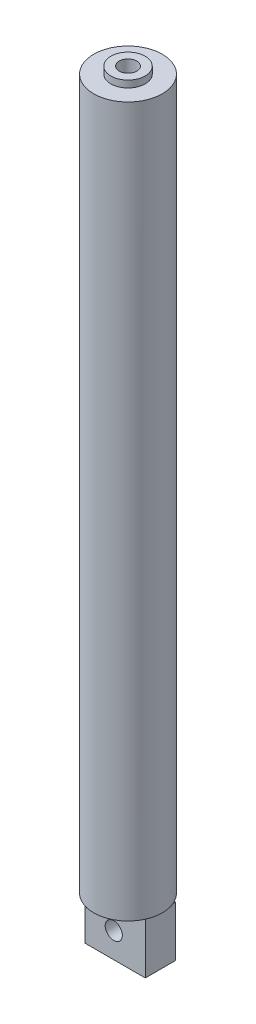
ISO-10303-21;
HEADER;
FILE_DESCRIPTION(('STEP AP214'),'2;1');
FILE_NAME('part.step','',(''),(''),'','','');
FILE_SCHEMA(('AUTOMOTIVE_DESIGN { 1 0 10303 214 1 1 1 1 }'));
ENDSEC;
DATA;
#1=APPLICATION_CONTEXT('core data for automotive mechanical design processes');
#2=APPLICATION_PROTOCOL_DEFINITION('international standard','automotive_design',2000,#1);
#3=PRODUCT_CONTEXT('',#1,'mechanical');
#4=PRODUCT('Part','Part','',(#3));
#5=PRODUCT_RELATED_PRODUCT_CATEGORY('part','',(#4));
#6=PRODUCT_DEFINITION_FORMATION('','',#4);
#7=PRODUCT_DEFINITION_CONTEXT('part definition',#1,'design');
#8=PRODUCT_DEFINITION('design','',#6,#7);
#9=PRODUCT_DEFINITION_SHAPE('','',#8);
#10=(LENGTH_UNIT() NAMED_UNIT(*) SI_UNIT(.MILLI.,.METRE.));
#11=(NAMED_UNIT(*) PLANE_ANGLE_UNIT() SI_UNIT($,.RADIAN.));
#12=(NAMED_UNIT(*) SI_UNIT($,.STERADIAN.) SOLID_ANGLE_UNIT());
#13=UNCERTAINTY_MEASURE_WITH_UNIT(LENGTH_MEASURE(1.E-05),#10,'distance_accuracy_value','');
#14=(GEOMETRIC_REPRESENTATION_CONTEXT(3) GLOBAL_UNCERTAINTY_ASSIGNED_CONTEXT((#13)) GLOBAL_UNIT_ASSIGNED_CONTEXT((#10,
#11,#12)) REPRESENTATION_CONTEXT('',''));
#15=CARTESIAN_POINT('',(0.,0.,0.));
#16=DIRECTION('',(0.,0.,1.));
#17=DIRECTION('',(1.,0.,0.));
#18=AXIS2_PLACEMENT_3D('',#15,#16,#17);
#19=CARTESIAN_POINT('',(0.,-4.31799999999993,0.));
#20=DIRECTION('',(0.,-1.,0.));
#21=DIRECTION('',(0.,0.,-1.));
#22=AXIS2_PLACEMENT_3D('',#19,#20,#21);
#23=PLANE('',#22);
#24=DIRECTION('',(0.,0.,1.));
#25=VECTOR('',#24,1.);
#26=CARTESIAN_POINT('',(-5.334,-4.31799999999993,2.64262624861142));
#27=LINE('',#26,#25);
#28=CARTESIAN_POINT('',(-5.334,-4.31799999999993,-2.93720091701856));
#29=VERTEX_POINT('',#28);
#30=CARTESIAN_POINT('',(-5.334,-4.31799999999993,2.64262624861142));
#31=VERTEX_POINT('',#30);
#32=EDGE_CURVE('E120',#29,#31,#27,.T.);
#33=ORIENTED_EDGE('',*,*,#32,.T.);
#34=DIRECTION('',(1.,0.,0.));
#35=VECTOR('',#34,1.);
#36=CARTESIAN_POINT('',(-5.334,-4.31799999999993,2.64262624861142));
#37=LINE('',#36,#35);
#38=CARTESIAN_POINT('',(5.77399571442081,-4.31799999999993,2.64262624861142));
#39=VERTEX_POINT('',#38);
#40=EDGE_CURVE('E107',#31,#39,#37,.T.);
#41=ORIENTED_EDGE('',*,*,#40,.T.);
#42=CARTESIAN_POINT('',(0.,-4.31799999999993,0.));
#43=DIRECTION('',(0.,-1.,0.));
#44=DIRECTION('',(0.,0.,-1.));
#45=AXIS2_PLACEMENT_3D('',#42,#43,#44);
#46=CIRCLE('',#45,6.35);
#47=CARTESIAN_POINT('',(5.62986241155726,-4.31799999999993,-2.93720091701856));
#48=VERTEX_POINT('',#47);
#49=EDGE_CURVE('E131',#39,#48,#46,.T.);
#50=ORIENTED_EDGE('',*,*,#49,.T.);
#51=DIRECTION('',(1.,0.,0.));
#52=VECTOR('',#51,1.);
#53=CARTESIAN_POINT('',(-5.334,-4.31799999999993,-2.93720091701856));
#54=LINE('',#53,#52);
#55=EDGE_CURVE('E129',#29,#48,#54,.T.);
#56=ORIENTED_EDGE('',*,*,#55,.F.);
#57=EDGE_LOOP('',(#33,#41,#50,#56));
#58=FACE_BOUND('',#57,.T.);
#59=ADVANCED_FACE('F33',(#58),#23,.T.);
#60=CARTESIAN_POINT('',(0.,127.,0.));
#61=DIRECTION('',(0.,1.,0.));
#62=DIRECTION('',(0.,0.,1.));
#63=AXIS2_PLACEMENT_3D('',#60,#61,#62);
#64=PLANE('',#63);
#65=CARTESIAN_POINT('',(0.,127.,0.));
#66=DIRECTION('',(0.,1.,0.));
#67=DIRECTION('',(0.,0.,1.));
#68=AXIS2_PLACEMENT_3D('',#65,#66,#67);
#69=CIRCLE('',#68,6.35);
#70=CARTESIAN_POINT('',(0.,127.,6.35));
#71=VERTEX_POINT('',#70);
#72=EDGE_CURVE('E42',#71,#71,#69,.T.);
#73=ORIENTED_EDGE('',*,*,#72,.T.);
#74=EDGE_LOOP('',(#73));
#75=FACE_BOUND('',#74,.T.);
#76=CARTESIAN_POINT('',(0.,127.,0.));
#77=DIRECTION('',(0.,1.,0.));
#78=DIRECTION('',(0.,0.,1.));
#79=AXIS2_PLACEMENT_3D('',#76,#77,#78);
#80=CIRCLE('',#79,3.175);
#81=CARTESIAN_POINT('',(0.,127.,3.175));
#82=VERTEX_POINT('',#81);
#83=EDGE_CURVE('E145',#82,#82,#80,.F.);
#84=ORIENTED_EDGE('',*,*,#83,.T.);
#85=EDGE_LOOP('',(#84));
#86=FACE_BOUND('',#85,.T.);
#87=ADVANCED_FACE('F168',(#75,#86),#64,.T.);
#88=CARTESIAN_POINT('',(0.,127.,0.));
#89=DIRECTION('',(0.,-1.,0.));
#90=DIRECTION('',(0.,0.,-1.));
#91=AXIS2_PLACEMENT_3D('',#88,#89,#90);
#92=CYLINDRICAL_SURFACE('',#91,6.35);
#93=ORIENTED_EDGE('',*,*,#72,.F.);
#94=EDGE_LOOP('',(#93));
#95=FACE_BOUND('',#94,.T.);
#96=CARTESIAN_POINT('',(5.84199999999994,-4.31799999999993,-2.48868157866786));
#97=VERTEX_POINT('',#96);
#98=EDGE_CURVE('E135',#48,#97,#46,.T.);
#99=ORIENTED_EDGE('',*,*,#98,.F.);
#100=ORIENTED_EDGE('',*,*,#49,.F.);
#101=CARTESIAN_POINT('',(5.84199999999994,-4.31799999999993,2.48868157866786));
#102=VERTEX_POINT('',#101);
#103=EDGE_CURVE('E104',#102,#39,#46,.T.);
#104=ORIENTED_EDGE('',*,*,#103,.F.);
#105=EDGE_CURVE('E138',#97,#102,#46,.T.);
#106=ORIENTED_EDGE('',*,*,#105,.F.);
#107=EDGE_LOOP('',(#99,#100,#104,#106));
#108=FACE_BOUND('',#107,.T.);
#109=ADVANCED_FACE('F35',(#95,#108),#92,.T.);
#110=CARTESIAN_POINT('',(0.,128.27,0.));
#111=DIRECTION('',(0.,-1.,0.));
#112=DIRECTION('',(0.,0.,-1.));
#113=AXIS2_PLACEMENT_3D('',#110,#111,#112);
#114=CYLINDRICAL_SURFACE('',#113,3.175);
#115=ORIENTED_EDGE('',*,*,#83,.F.);
#116=EDGE_LOOP('',(#115));
#117=FACE_BOUND('',#116,.T.);
#118=CARTESIAN_POINT('',(0.,128.27,0.));
#119=DIRECTION('',(0.,1.,0.));
#120=DIRECTION('',(0.,0.,1.));
#121=AXIS2_PLACEMENT_3D('',#118,#119,#120);
#122=CIRCLE('',#121,3.175);
#123=CARTESIAN_POINT('',(0.,128.27,3.175));
#124=VERTEX_POINT('',#123);
#125=EDGE_CURVE('E142',#124,#124,#122,.T.);
#126=ORIENTED_EDGE('',*,*,#125,.F.);
#127=EDGE_LOOP('',(#126));
#128=FACE_BOUND('',#127,.T.);
#129=ADVANCED_FACE('F158',(#117,#128),#114,.T.);
#130=CARTESIAN_POINT('',(0.,128.27,0.));
#131=DIRECTION('',(0.,1.,0.));
#132=DIRECTION('',(0.,0.,1.));
#133=AXIS2_PLACEMENT_3D('',#130,#131,#132);
#134=PLANE('',#133);
#135=CARTESIAN_POINT('',(0.,128.27,0.));
#136=DIRECTION('',(0.,1.,0.));
#137=DIRECTION('',(0.,0.,1.));
#138=AXIS2_PLACEMENT_3D('',#135,#136,#137);
#139=CIRCLE('',#138,1.6256);
#140=CARTESIAN_POINT('',(0.,128.27,1.6256));
#141=VERTEX_POINT('',#140);
#142=EDGE_CURVE('E137',#141,#141,#139,.T.);
#143=ORIENTED_EDGE('',*,*,#142,.F.);
#144=EDGE_LOOP('',(#143));
#145=FACE_BOUND('',#144,.T.);
#146=ORIENTED_EDGE('',*,*,#125,.T.);
#147=EDGE_LOOP('',(#146));
#148=FACE_BOUND('',#147,.T.);
#149=ADVANCED_FACE('F155',(#145,#148),#134,.T.);
#150=CARTESIAN_POINT('',(0.,-0.254,0.));
#151=DIRECTION('',(0.,1.,0.));
#152=DIRECTION('',(0.,0.,1.));
#153=AXIS2_PLACEMENT_3D('',#150,#151,#152);
#154=CYLINDRICAL_SURFACE('',#153,1.6256);
#155=ORIENTED_EDGE('',*,*,#142,.T.);
#156=EDGE_LOOP('',(#155));
#157=FACE_BOUND('',#156,.T.);
#158=CARTESIAN_POINT('',(0.,0.,0.));
#159=DIRECTION('',(0.,1.,0.));
#160=DIRECTION('',(0.,0.,1.));
#161=AXIS2_PLACEMENT_3D('',#158,#159,#160);
#162=CIRCLE('',#161,1.6256);
#163=CARTESIAN_POINT('',(0.,0.,1.6256));
#164=VERTEX_POINT('',#163);
#165=EDGE_CURVE('E139',#164,#164,#162,.T.);
#166=ORIENTED_EDGE('',*,*,#165,.F.);
#167=EDGE_LOOP('',(#166));
#168=FACE_BOUND('',#167,.T.);
#169=ADVANCED_FACE('F152',(#157,#168),#154,.F.);
#170=CARTESIAN_POINT('',(0.,0.,0.));
#171=DIRECTION('',(0.,-1.,0.));
#172=DIRECTION('',(0.,0.,-1.));
#173=AXIS2_PLACEMENT_3D('',#170,#171,#172);
#174=PLANE('',#173);
#175=ORIENTED_EDGE('',*,*,#165,.T.);
#176=EDGE_LOOP('',(#175));
#177=FACE_BOUND('',#176,.T.);
#178=ADVANCED_FACE('F183',(#177),#174,.F.);
#179=DIRECTION('',(0.,0.,1.));
#180=VECTOR('',#179,1.);
#181=CARTESIAN_POINT('',(5.84199999999994,-4.31799999999993,2.64262624861142));
#182=LINE('',#181,#180);
#183=EDGE_CURVE('E11',#97,#102,#182,.T.);
#184=ORIENTED_EDGE('',*,*,#183,.F.);
#185=ORIENTED_EDGE('',*,*,#105,.T.);
#186=EDGE_LOOP('',(#184,#185));
#187=FACE_BOUND('',#186,.T.);
#188=ADVANCED_FACE('F174',(#187),#23,.T.);
#189=CARTESIAN_POINT('',(-5.334,-4.31799999999993,2.64262624861142));
#190=DIRECTION('',(0.,1.,0.));
#191=DIRECTION('',(0.,0.,1.));
#192=AXIS2_PLACEMENT_3D('',#189,#190,#191);
#193=PLANE('',#192);
#194=CARTESIAN_POINT('',(5.84199999999994,-4.31799999999993,-2.93720091701856));
#195=VERTEX_POINT('',#194);
#196=EDGE_CURVE('E60',#48,#195,#54,.T.);
#197=ORIENTED_EDGE('',*,*,#196,.F.);
#198=ORIENTED_EDGE('',*,*,#98,.T.);
#199=EDGE_CURVE('E44',#195,#97,#182,.T.);
#200=ORIENTED_EDGE('',*,*,#199,.F.);
#201=EDGE_LOOP('',(#197,#198,#200));
#202=FACE_BOUND('',#201,.T.);
#203=ADVANCED_FACE('F182',(#202),#193,.T.);
#204=CARTESIAN_POINT('',(5.84199999999994,-4.31799999999993,2.64262624861142));
#205=VERTEX_POINT('',#204);
#206=EDGE_CURVE('E45',#102,#205,#182,.T.);
#207=ORIENTED_EDGE('',*,*,#206,.F.);
#208=ORIENTED_EDGE('',*,*,#103,.T.);
#209=EDGE_CURVE('E102',#39,#205,#37,.T.);
#210=ORIENTED_EDGE('',*,*,#209,.T.);
#211=EDGE_LOOP('',(#207,#208,#210));
#212=FACE_BOUND('',#211,.T.);
#213=ADVANCED_FACE('F103',(#212),#193,.T.);
#214=CARTESIAN_POINT('',(-5.334,-4.31799999999993,-2.93720091701856));
#215=DIRECTION('',(0.,0.,-1.));
#216=DIRECTION('',(-1.,0.,0.));
#217=AXIS2_PLACEMENT_3D('',#214,#215,#216);
#218=PLANE('',#217);
#219=CARTESIAN_POINT('',(0.,-9.00678468141407,-2.93720091701856));
#220=DIRECTION('',(0.,0.,-1.));
#221=DIRECTION('',(-1.,0.,0.));
#222=AXIS2_PLACEMENT_3D('',#219,#220,#221);
#223=CIRCLE('',#222,1.5875);
#224=CARTESIAN_POINT('',(-1.5875,-9.00678468141407,-2.93720091701856));
#225=VERTEX_POINT('',#224);
#226=EDGE_CURVE('E100',#225,#225,#223,.T.);
#227=ORIENTED_EDGE('',*,*,#226,.F.);
#228=EDGE_LOOP('',(#227));
#229=FACE_BOUND('',#228,.T.);
#230=ORIENTED_EDGE('',*,*,#55,.T.);
#231=ORIENTED_EDGE('',*,*,#196,.T.);
#232=DIRECTION('',(0.,1.,0.));
#233=VECTOR('',#232,1.);
#234=CARTESIAN_POINT('',(5.84199999999994,-4.31799999999993,-2.93720091701856));
#235=LINE('',#234,#233);
#236=CARTESIAN_POINT('',(5.84199999999994,-13.6955693628282,-2.93720091701856));
#237=VERTEX_POINT('',#236);
#238=EDGE_CURVE('E114',#237,#195,#235,.T.);
#239=ORIENTED_EDGE('',*,*,#238,.F.);
#240=DIRECTION('',(1.,0.,0.));
#241=VECTOR('',#240,1.);
#242=CARTESIAN_POINT('',(-5.334,-13.6955693628282,-2.93720091701856));
#243=LINE('',#242,#241);
#244=CARTESIAN_POINT('',(-5.334,-13.6955693628282,-2.93720091701856));
#245=VERTEX_POINT('',#244);
#246=EDGE_CURVE('E132',#245,#237,#243,.T.);
#247=ORIENTED_EDGE('',*,*,#246,.F.);
#248=DIRECTION('',(0.,1.,0.));
#249=VECTOR('',#248,1.);
#250=CARTESIAN_POINT('',(-5.334,-4.31799999999993,-2.93720091701856));
#251=LINE('',#250,#249);
#252=EDGE_CURVE('E108',#245,#29,#251,.T.);
#253=ORIENTED_EDGE('',*,*,#252,.T.);
#254=EDGE_LOOP('',(#230,#231,#239,#247,#253));
#255=FACE_BOUND('',#254,.T.);
#256=ADVANCED_FACE('F200',(#229,#255),#218,.T.);
#257=CARTESIAN_POINT('',(-5.334,-13.6955693628282,-2.93720091701856));
#258=DIRECTION('',(0.,-1.,0.));
#259=DIRECTION('',(0.,0.,-1.));
#260=AXIS2_PLACEMENT_3D('',#257,#258,#259);
#261=PLANE('',#260);
#262=ORIENTED_EDGE('',*,*,#246,.T.);
#263=DIRECTION('',(0.,0.,-1.));
#264=VECTOR('',#263,1.);
#265=CARTESIAN_POINT('',(5.84199999999994,-13.6955693628282,-2.93720091701856));
#266=LINE('',#265,#264);
#267=CARTESIAN_POINT('',(5.84199999999994,-13.6955693628282,2.64262624861142));
#268=VERTEX_POINT('',#267);
#269=EDGE_CURVE('E112',#268,#237,#266,.T.);
#270=ORIENTED_EDGE('',*,*,#269,.F.);
#271=DIRECTION('',(1.,0.,0.));
#272=VECTOR('',#271,1.);
#273=CARTESIAN_POINT('',(-5.334,-13.6955693628282,2.64262624861142));
#274=LINE('',#273,#272);
#275=CARTESIAN_POINT('',(-5.334,-13.6955693628282,2.64262624861142));
#276=VERTEX_POINT('',#275);
#277=EDGE_CURVE('E111',#276,#268,#274,.T.);
#278=ORIENTED_EDGE('',*,*,#277,.F.);
#279=DIRECTION('',(0.,0.,-1.));
#280=VECTOR('',#279,1.);
#281=CARTESIAN_POINT('',(-5.334,-13.6955693628282,-2.93720091701856));
#282=LINE('',#281,#280);
#283=EDGE_CURVE('E124',#276,#245,#282,.T.);
#284=ORIENTED_EDGE('',*,*,#283,.T.);
#285=EDGE_LOOP('',(#262,#270,#278,#284));
#286=FACE_BOUND('',#285,.T.);
#287=ADVANCED_FACE('F203',(#286),#261,.T.);
#288=CARTESIAN_POINT('',(-5.334,-13.6955693628282,2.64262624861142));
#289=DIRECTION('',(0.,0.,1.));
#290=DIRECTION('',(1.,0.,0.));
#291=AXIS2_PLACEMENT_3D('',#288,#289,#290);
#292=PLANE('',#291);
#293=CARTESIAN_POINT('',(0.,-9.00678468141407,2.64262624861142));
#294=DIRECTION('',(0.,0.,1.));
#295=DIRECTION('',(1.,0.,0.));
#296=AXIS2_PLACEMENT_3D('',#293,#294,#295);
#297=CIRCLE('',#296,1.5875);
#298=CARTESIAN_POINT('',(1.5875,-9.00678468141407,2.64262624861142));
#299=VERTEX_POINT('',#298);
#300=EDGE_CURVE('E37',#299,#299,#297,.T.);
#301=ORIENTED_EDGE('',*,*,#300,.F.);
#302=EDGE_LOOP('',(#301));
#303=FACE_BOUND('',#302,.T.);
#304=ORIENTED_EDGE('',*,*,#277,.T.);
#305=DIRECTION('',(0.,-1.,0.));
#306=VECTOR('',#305,1.);
#307=CARTESIAN_POINT('',(5.84199999999994,-13.6955693628282,2.64262624861142));
#308=LINE('',#307,#306);
#309=EDGE_CURVE('E95',#205,#268,#308,.T.);
#310=ORIENTED_EDGE('',*,*,#309,.F.);
#311=ORIENTED_EDGE('',*,*,#209,.F.);
#312=ORIENTED_EDGE('',*,*,#40,.F.);
#313=DIRECTION('',(0.,-1.,0.));
#314=VECTOR('',#313,1.);
#315=CARTESIAN_POINT('',(-5.334,-13.6955693628282,2.64262624861142));
#316=LINE('',#315,#314);
#317=EDGE_CURVE('E52',#31,#276,#316,.T.);
#318=ORIENTED_EDGE('',*,*,#317,.T.);
#319=EDGE_LOOP('',(#304,#310,#311,#312,#318));
#320=FACE_BOUND('',#319,.T.);
#321=ADVANCED_FACE('F110',(#303,#320),#292,.T.);
#322=CARTESIAN_POINT('',(-5.334,0.,0.));
#323=DIRECTION('',(-1.,0.,0.));
#324=DIRECTION('',(0.,0.,1.));
#325=AXIS2_PLACEMENT_3D('',#322,#323,#324);
#326=PLANE('',#325);
#327=ORIENTED_EDGE('',*,*,#32,.F.);
#328=ORIENTED_EDGE('',*,*,#252,.F.);
#329=ORIENTED_EDGE('',*,*,#283,.F.);
#330=ORIENTED_EDGE('',*,*,#317,.F.);
#331=EDGE_LOOP('',(#327,#328,#329,#330));
#332=FACE_BOUND('',#331,.T.);
#333=ADVANCED_FACE('F198',(#332),#326,.T.);
#334=CARTESIAN_POINT('',(5.84199999999994,0.,0.));
#335=DIRECTION('',(-1.,0.,0.));
#336=DIRECTION('',(0.,0.,1.));
#337=AXIS2_PLACEMENT_3D('',#334,#335,#336);
#338=PLANE('',#337);
#339=ORIENTED_EDGE('',*,*,#199,.T.);
#340=ORIENTED_EDGE('',*,*,#183,.T.);
#341=ORIENTED_EDGE('',*,*,#206,.T.);
#342=ORIENTED_EDGE('',*,*,#309,.T.);
#343=ORIENTED_EDGE('',*,*,#269,.T.);
#344=ORIENTED_EDGE('',*,*,#238,.T.);
#345=EDGE_LOOP('',(#339,#340,#341,#342,#343,#344));
#346=FACE_BOUND('',#345,.T.);
#347=ADVANCED_FACE('F92',(#346),#338,.F.);
#348=CARTESIAN_POINT('',(0.,-9.00678468141407,-64.262));
#349=DIRECTION('',(0.,0.,1.));
#350=DIRECTION('',(1.,0.,0.));
#351=AXIS2_PLACEMENT_3D('',#348,#349,#350);
#352=CYLINDRICAL_SURFACE('',#351,1.5875);
#353=ORIENTED_EDGE('',*,*,#226,.T.);
#354=EDGE_LOOP('',(#353));
#355=FACE_BOUND('',#354,.T.);
#356=ORIENTED_EDGE('',*,*,#300,.T.);
#357=EDGE_LOOP('',(#356));
#358=FACE_BOUND('',#357,.T.);
#359=ADVANCED_FACE('F243',(#355,#358),#352,.F.);
#360=CLOSED_SHELL('',(#59,#87,#109,#129,#149,#169,#178,#188,#203,#213,#256,#287,#321,#333,#347,#359));
#361=MANIFOLD_SOLID_BREP('B2',#360);
#362=ADVANCED_BREP_SHAPE_REPRESENTATION('',(#18,#361),#14);
#363=SHAPE_DEFINITION_REPRESENTATION(#9,#362);
ENDSEC;
END-ISO-10303-21;
